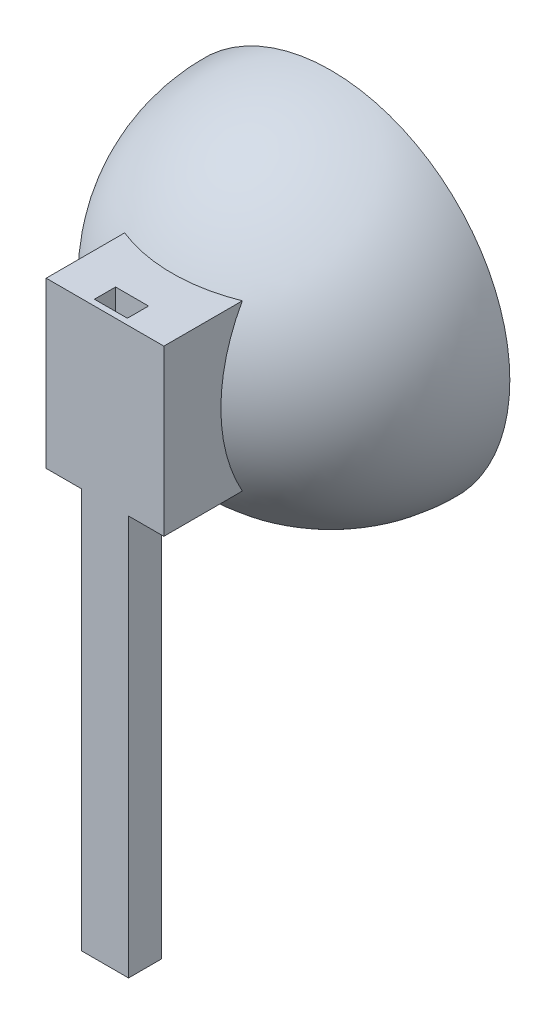
ISO-10303-21;
HEADER;
FILE_DESCRIPTION(('STEP AP214'),'2;1');
FILE_NAME('part.step','',(''),(''),'','','');
FILE_SCHEMA(('AUTOMOTIVE_DESIGN { 1 0 10303 214 1 1 1 1 }'));
ENDSEC;
DATA;
#1=APPLICATION_CONTEXT('core data for automotive mechanical design processes');
#2=APPLICATION_PROTOCOL_DEFINITION('international standard','automotive_design',2000,#1);
#3=PRODUCT_CONTEXT('',#1,'mechanical');
#4=PRODUCT('Part','Part','',(#3));
#5=PRODUCT_RELATED_PRODUCT_CATEGORY('part','',(#4));
#6=PRODUCT_DEFINITION_FORMATION('','',#4);
#7=PRODUCT_DEFINITION_CONTEXT('part definition',#1,'design');
#8=PRODUCT_DEFINITION('design','',#6,#7);
#9=PRODUCT_DEFINITION_SHAPE('','',#8);
#10=(LENGTH_UNIT() NAMED_UNIT(*) SI_UNIT(.MILLI.,.METRE.));
#11=(NAMED_UNIT(*) PLANE_ANGLE_UNIT() SI_UNIT($,.RADIAN.));
#12=(NAMED_UNIT(*) SI_UNIT($,.STERADIAN.) SOLID_ANGLE_UNIT());
#13=UNCERTAINTY_MEASURE_WITH_UNIT(LENGTH_MEASURE(1.E-05),#10,'distance_accuracy_value','');
#14=(GEOMETRIC_REPRESENTATION_CONTEXT(3) GLOBAL_UNCERTAINTY_ASSIGNED_CONTEXT((#13)) GLOBAL_UNIT_ASSIGNED_CONTEXT((#10,
#11,#12)) REPRESENTATION_CONTEXT('',''));
#15=CARTESIAN_POINT('',(0.,0.,0.));
#16=DIRECTION('',(0.,0.,1.));
#17=DIRECTION('',(1.,0.,0.));
#18=AXIS2_PLACEMENT_3D('',#15,#16,#17);
#19=CARTESIAN_POINT('',(0.,0.,0.));
#20=DIRECTION('',(0.,1.,0.));
#21=DIRECTION('',(1.,0.,0.));
#22=AXIS2_PLACEMENT_3D('',#19,#20,#21);
#23=SPHERICAL_SURFACE('',#22,33.);
#24=CARTESIAN_POINT('',(0.,0.,0.));
#25=DIRECTION('',(0.,0.,1.));
#26=DIRECTION('',(-1.,0.,0.));
#27=AXIS2_PLACEMENT_3D('',#24,#25,#26);
#28=SPHERICAL_SURFACE('',#27,33.);
#29=CARTESIAN_POINT('',(0.,0.,0.));
#30=DIRECTION('',(0.,0.,1.));
#31=DIRECTION('',(-1.,0.,0.));
#32=AXIS2_PLACEMENT_3D('',#29,#30,#31);
#33=CIRCLE('',#32,33.);
#34=CARTESIAN_POINT('',(-33.,0.,-2.30437768363647E-13));
#35=VERTEX_POINT('',#34);
#36=EDGE_CURVE('E46',#35,#35,#33,.T.);
#37=ORIENTED_EDGE('',*,*,#36,.F.);
#38=EDGE_LOOP('',(#37));
#39=FACE_BOUND('',#38,.T.);
#40=ADVANCED_FACE('F38',(#39),#28,.F.);
#41=CARTESIAN_POINT('',(0.,0.,0.));
#42=DIRECTION('',(0.,1.,0.));
#43=DIRECTION('',(1.,0.,0.));
#44=AXIS2_PLACEMENT_3D('',#41,#42,#43);
#45=SPHERICAL_SURFACE('',#44,38.);
#46=CARTESIAN_POINT('',(0.,-17.5,0.));
#47=DIRECTION('',(0.,1.,0.));
#48=DIRECTION('',(0.,0.,1.));
#49=AXIS2_PLACEMENT_3D('',#46,#47,#48);
#50=CIRCLE('',#49,33.7305499510459);
#51=CARTESIAN_POINT('',(12.4999999999998,-17.5,31.3289003956412));
#52=VERTEX_POINT('',#51);
#53=CARTESIAN_POINT('',(-12.5000000000002,-17.5,31.328900395641));
#54=VERTEX_POINT('',#53);
#55=EDGE_CURVE('E192',#52,#54,#50,.F.);
#56=ORIENTED_EDGE('',*,*,#55,.T.);
#57=CARTESIAN_POINT('',(-12.5,0.,0.));
#58=DIRECTION('',(1.,0.,0.));
#59=DIRECTION('',(0.,0.,-1.));
#60=AXIS2_PLACEMENT_3D('',#57,#58,#59);
#61=CIRCLE('',#60,35.8852337319962);
#62=CARTESIAN_POINT('',(-12.5000000000002,17.5,31.328900395641));
#63=VERTEX_POINT('',#62);
#64=EDGE_CURVE('E191',#54,#63,#61,.F.);
#65=ORIENTED_EDGE('',*,*,#64,.T.);
#66=CARTESIAN_POINT('',(0.,17.5,0.));
#67=DIRECTION('',(0.,-1.,0.));
#68=DIRECTION('',(0.,0.,-1.));
#69=AXIS2_PLACEMENT_3D('',#66,#67,#68);
#70=CIRCLE('',#69,33.7305499510459);
#71=CARTESIAN_POINT('',(12.4999999999998,17.5,31.3289003956412));
#72=VERTEX_POINT('',#71);
#73=EDGE_CURVE('E199',#63,#72,#70,.F.);
#74=ORIENTED_EDGE('',*,*,#73,.T.);
#75=CARTESIAN_POINT('',(12.5,0.,0.));
#76=DIRECTION('',(-1.,0.,0.));
#77=DIRECTION('',(0.,0.,1.));
#78=AXIS2_PLACEMENT_3D('',#75,#76,#77);
#79=CIRCLE('',#78,35.8852337319962);
#80=EDGE_CURVE('E196',#72,#52,#79,.F.);
#81=ORIENTED_EDGE('',*,*,#80,.T.);
#82=EDGE_LOOP('',(#56,#65,#74,#81));
#83=FACE_BOUND('',#82,.T.);
#84=CARTESIAN_POINT('',(0.,0.,0.));
#85=DIRECTION('',(0.,0.,-1.));
#86=DIRECTION('',(-1.,0.,0.));
#87=AXIS2_PLACEMENT_3D('',#84,#85,#86);
#88=CIRCLE('',#87,38.);
#89=CARTESIAN_POINT('',(-38.,0.,-2.65352581752078E-13));
#90=VERTEX_POINT('',#89);
#91=EDGE_CURVE('E11',#90,#90,#88,.T.);
#92=ORIENTED_EDGE('',*,*,#91,.F.);
#93=EDGE_LOOP('',(#92));
#94=FACE_BOUND('',#93,.T.);
#95=ADVANCED_FACE('F40',(#83,#94),#45,.T.);
#96=CARTESIAN_POINT('',(0.,0.,0.));
#97=DIRECTION('',(0.,0.,-1.));
#98=DIRECTION('',(-1.,0.,0.));
#99=AXIS2_PLACEMENT_3D('',#96,#97,#98);
#100=PLANE('',#99);
#101=ORIENTED_EDGE('',*,*,#91,.T.);
#102=EDGE_LOOP('',(#101));
#103=FACE_BOUND('',#102,.T.);
#104=ORIENTED_EDGE('',*,*,#36,.T.);
#105=EDGE_LOOP('',(#104));
#106=FACE_BOUND('',#105,.T.);
#107=ADVANCED_FACE('F225',(#103,#106),#100,.T.);
#108=CARTESIAN_POINT('',(-12.5000000000003,-17.5,47.9999999999999));
#109=DIRECTION('',(-1.,0.,0.));
#110=DIRECTION('',(0.,0.,1.));
#111=AXIS2_PLACEMENT_3D('',#108,#109,#110);
#112=PLANE('',#111);
#113=DIRECTION('',(0.,0.,-1.));
#114=VECTOR('',#113,1.);
#115=CARTESIAN_POINT('',(-12.5000000000003,17.5,47.9999999999999));
#116=LINE('',#115,#114);
#117=CARTESIAN_POINT('',(-12.5000000000003,17.5,47.9999999999999));
#118=VERTEX_POINT('',#117);
#119=EDGE_CURVE('E214',#118,#63,#116,.T.);
#120=ORIENTED_EDGE('',*,*,#119,.T.);
#121=ORIENTED_EDGE('',*,*,#64,.F.);
#122=DIRECTION('',(0.,0.,-1.));
#123=VECTOR('',#122,1.);
#124=CARTESIAN_POINT('',(-12.5000000000003,-17.5,47.9999999999999));
#125=LINE('',#124,#123);
#126=CARTESIAN_POINT('',(-12.5000000000003,-17.5,47.9999999999999));
#127=VERTEX_POINT('',#126);
#128=EDGE_CURVE('E215',#127,#54,#125,.T.);
#129=ORIENTED_EDGE('',*,*,#128,.F.);
#130=DIRECTION('',(0.,1.,0.));
#131=VECTOR('',#130,1.);
#132=CARTESIAN_POINT('',(-12.5000000000003,-17.5,47.9999999999999));
#133=LINE('',#132,#131);
#134=EDGE_CURVE('E195',#127,#118,#133,.T.);
#135=ORIENTED_EDGE('',*,*,#134,.T.);
#136=EDGE_LOOP('',(#120,#121,#129,#135));
#137=FACE_BOUND('',#136,.T.);
#138=ADVANCED_FACE('F235',(#137),#112,.T.);
#139=CARTESIAN_POINT('',(12.4999999999997,-17.5,48.0000000000001));
#140=DIRECTION('',(0.,-1.,0.));
#141=DIRECTION('',(0.,0.,-1.));
#142=AXIS2_PLACEMENT_3D('',#139,#140,#141);
#143=PLANE('',#142);
#144=DIRECTION('',(0.,0.,-1.));
#145=VECTOR('',#144,1.);
#146=CARTESIAN_POINT('',(-5.00000000000034,-17.5,48.0000000000001));
#147=LINE('',#146,#145);
#148=CARTESIAN_POINT('',(-5.00000000000034,-17.5,48.));
#149=VERTEX_POINT('',#148);
#150=CARTESIAN_POINT('',(-5.00000000000034,-17.5,41.));
#151=VERTEX_POINT('',#150);
#152=EDGE_CURVE('E186',#149,#151,#147,.T.);
#153=ORIENTED_EDGE('',*,*,#152,.F.);
#154=DIRECTION('',(-1.,0.,0.));
#155=VECTOR('',#154,1.);
#156=CARTESIAN_POINT('',(12.4999999999997,-17.5,48.0000000000001));
#157=LINE('',#156,#155);
#158=EDGE_CURVE('E211',#149,#127,#157,.T.);
#159=ORIENTED_EDGE('',*,*,#158,.T.);
#160=ORIENTED_EDGE('',*,*,#128,.T.);
#161=ORIENTED_EDGE('',*,*,#55,.F.);
#162=DIRECTION('',(0.,0.,-1.));
#163=VECTOR('',#162,1.);
#164=CARTESIAN_POINT('',(12.4999999999997,-17.5,48.0000000000001));
#165=LINE('',#164,#163);
#166=CARTESIAN_POINT('',(12.4999999999997,-17.5,48.0000000000001));
#167=VERTEX_POINT('',#166);
#168=EDGE_CURVE('E217',#167,#52,#165,.T.);
#169=ORIENTED_EDGE('',*,*,#168,.F.);
#170=CARTESIAN_POINT('',(4.99999999999966,-17.5,48.));
#171=VERTEX_POINT('',#170);
#172=EDGE_CURVE('E212',#167,#171,#157,.T.);
#173=ORIENTED_EDGE('',*,*,#172,.T.);
#174=DIRECTION('',(0.,0.,1.));
#175=VECTOR('',#174,1.);
#176=CARTESIAN_POINT('',(4.99999999999966,-17.5,48.0000000000001));
#177=LINE('',#176,#175);
#178=CARTESIAN_POINT('',(4.99999999999967,-17.5,41.));
#179=VERTEX_POINT('',#178);
#180=EDGE_CURVE('E181',#179,#171,#177,.T.);
#181=ORIENTED_EDGE('',*,*,#180,.F.);
#182=DIRECTION('',(-1.,0.,0.));
#183=VECTOR('',#182,1.);
#184=CARTESIAN_POINT('',(12.4999999999997,-17.5,41.));
#185=LINE('',#184,#183);
#186=EDGE_CURVE('E189',#179,#151,#185,.T.);
#187=ORIENTED_EDGE('',*,*,#186,.T.);
#188=EDGE_LOOP('',(#153,#159,#160,#161,#169,#173,#181,#187));
#189=FACE_BOUND('',#188,.T.);
#190=ADVANCED_FACE('F239',(#189),#143,.T.);
#191=CARTESIAN_POINT('',(12.4999999999997,-17.5,48.0000000000001));
#192=DIRECTION('',(1.,0.,0.));
#193=DIRECTION('',(0.,0.,-1.));
#194=AXIS2_PLACEMENT_3D('',#191,#192,#193);
#195=PLANE('',#194);
#196=ORIENTED_EDGE('',*,*,#168,.T.);
#197=ORIENTED_EDGE('',*,*,#80,.F.);
#198=DIRECTION('',(0.,0.,-1.));
#199=VECTOR('',#198,1.);
#200=CARTESIAN_POINT('',(12.4999999999997,17.5,48.0000000000001));
#201=LINE('',#200,#199);
#202=CARTESIAN_POINT('',(12.4999999999997,17.5,48.0000000000001));
#203=VERTEX_POINT('',#202);
#204=EDGE_CURVE('E219',#203,#72,#201,.T.);
#205=ORIENTED_EDGE('',*,*,#204,.F.);
#206=DIRECTION('',(0.,-1.,0.));
#207=VECTOR('',#206,1.);
#208=CARTESIAN_POINT('',(12.4999999999997,-17.5,48.0000000000001));
#209=LINE('',#208,#207);
#210=EDGE_CURVE('E208',#203,#167,#209,.T.);
#211=ORIENTED_EDGE('',*,*,#210,.T.);
#212=EDGE_LOOP('',(#196,#197,#205,#211));
#213=FACE_BOUND('',#212,.T.);
#214=ADVANCED_FACE('F245',(#213),#195,.T.);
#215=CARTESIAN_POINT('',(12.4999999999997,17.5,48.0000000000001));
#216=DIRECTION('',(0.,1.,0.));
#217=DIRECTION('',(0.,0.,1.));
#218=AXIS2_PLACEMENT_3D('',#215,#216,#217);
#219=PLANE('',#218);
#220=DIRECTION('',(0.,0.,-1.));
#221=VECTOR('',#220,1.);
#222=CARTESIAN_POINT('',(3.49999999999969,17.5,48.0000000000001));
#223=LINE('',#222,#221);
#224=CARTESIAN_POINT('',(3.49999999999969,17.5,46.75));
#225=VERTEX_POINT('',#224);
#226=CARTESIAN_POINT('',(3.49999999999969,17.5,42.25));
#227=VERTEX_POINT('',#226);
#228=EDGE_CURVE('E160',#225,#227,#223,.T.);
#229=ORIENTED_EDGE('',*,*,#228,.F.);
#230=DIRECTION('',(1.,0.,0.));
#231=VECTOR('',#230,1.);
#232=CARTESIAN_POINT('',(12.4999999999997,17.5,46.75));
#233=LINE('',#232,#231);
#234=CARTESIAN_POINT('',(-3.50000000000031,17.5,46.75));
#235=VERTEX_POINT('',#234);
#236=EDGE_CURVE('E153',#235,#225,#233,.T.);
#237=ORIENTED_EDGE('',*,*,#236,.F.);
#238=DIRECTION('',(0.,0.,1.));
#239=VECTOR('',#238,1.);
#240=CARTESIAN_POINT('',(-3.50000000000031,17.5,48.0000000000001));
#241=LINE('',#240,#239);
#242=CARTESIAN_POINT('',(-3.50000000000031,17.5,42.25));
#243=VERTEX_POINT('',#242);
#244=EDGE_CURVE('E133',#243,#235,#241,.T.);
#245=ORIENTED_EDGE('',*,*,#244,.F.);
#246=DIRECTION('',(-1.,0.,0.));
#247=VECTOR('',#246,1.);
#248=CARTESIAN_POINT('',(12.4999999999997,17.5,42.25));
#249=LINE('',#248,#247);
#250=EDGE_CURVE('E158',#227,#243,#249,.T.);
#251=ORIENTED_EDGE('',*,*,#250,.F.);
#252=EDGE_LOOP('',(#229,#237,#245,#251));
#253=FACE_BOUND('',#252,.T.);
#254=DIRECTION('',(1.,0.,0.));
#255=VECTOR('',#254,1.);
#256=CARTESIAN_POINT('',(12.4999999999997,17.5,48.0000000000001));
#257=LINE('',#256,#255);
#258=EDGE_CURVE('E206',#118,#203,#257,.T.);
#259=ORIENTED_EDGE('',*,*,#258,.T.);
#260=ORIENTED_EDGE('',*,*,#204,.T.);
#261=ORIENTED_EDGE('',*,*,#73,.F.);
#262=ORIENTED_EDGE('',*,*,#119,.F.);
#263=EDGE_LOOP('',(#259,#260,#261,#262));
#264=FACE_BOUND('',#263,.T.);
#265=ADVANCED_FACE('F241',(#253,#264),#219,.T.);
#266=CARTESIAN_POINT('',(-3.44054713859276E-13,0.,48.));
#267=DIRECTION('',(0.,0.,1.));
#268=DIRECTION('',(1.,0.,0.));
#269=AXIS2_PLACEMENT_3D('',#266,#267,#268);
#270=PLANE('',#269);
#271=ORIENTED_EDGE('',*,*,#210,.F.);
#272=ORIENTED_EDGE('',*,*,#258,.F.);
#273=ORIENTED_EDGE('',*,*,#134,.F.);
#274=ORIENTED_EDGE('',*,*,#158,.F.);
#275=DIRECTION('',(0.,-1.,0.));
#276=VECTOR('',#275,1.);
#277=CARTESIAN_POINT('',(-5.00000000000035,17.5,48.));
#278=LINE('',#277,#276);
#279=CARTESIAN_POINT('',(-5.00000000000033,-102.5,48.));
#280=VERTEX_POINT('',#279);
#281=EDGE_CURVE('E162',#149,#280,#278,.T.);
#282=ORIENTED_EDGE('',*,*,#281,.T.);
#283=DIRECTION('',(1.,0.,0.));
#284=VECTOR('',#283,1.);
#285=CARTESIAN_POINT('',(-5.00000000000033,-102.5,48.));
#286=LINE('',#285,#284);
#287=CARTESIAN_POINT('',(4.99999999999967,-102.5,48.));
#288=VERTEX_POINT('',#287);
#289=EDGE_CURVE('E174',#280,#288,#286,.T.);
#290=ORIENTED_EDGE('',*,*,#289,.T.);
#291=DIRECTION('',(0.,1.,0.));
#292=VECTOR('',#291,1.);
#293=CARTESIAN_POINT('',(4.99999999999965,17.5,48.));
#294=LINE('',#293,#292);
#295=EDGE_CURVE('E166',#288,#171,#294,.T.);
#296=ORIENTED_EDGE('',*,*,#295,.T.);
#297=ORIENTED_EDGE('',*,*,#172,.F.);
#298=EDGE_LOOP('',(#271,#272,#273,#274,#282,#290,#296,#297));
#299=FACE_BOUND('',#298,.T.);
#300=ADVANCED_FACE('F244',(#299),#270,.T.);
#301=CARTESIAN_POINT('',(-5.00000000000035,17.5,41.));
#302=DIRECTION('',(-1.,0.,0.));
#303=DIRECTION('',(0.,-1.,0.));
#304=AXIS2_PLACEMENT_3D('',#301,#302,#303);
#305=PLANE('',#304);
#306=ORIENTED_EDGE('',*,*,#281,.F.);
#307=ORIENTED_EDGE('',*,*,#152,.T.);
#308=DIRECTION('',(0.,-1.,0.));
#309=VECTOR('',#308,1.);
#310=CARTESIAN_POINT('',(-5.00000000000035,17.5,41.));
#311=LINE('',#310,#309);
#312=CARTESIAN_POINT('',(-5.00000000000033,-102.5,41.));
#313=VERTEX_POINT('',#312);
#314=EDGE_CURVE('E163',#151,#313,#311,.T.);
#315=ORIENTED_EDGE('',*,*,#314,.T.);
#316=DIRECTION('',(0.,0.,1.));
#317=VECTOR('',#316,1.);
#318=CARTESIAN_POINT('',(-5.00000000000033,-102.5,41.));
#319=LINE('',#318,#317);
#320=EDGE_CURVE('E172',#313,#280,#319,.T.);
#321=ORIENTED_EDGE('',*,*,#320,.T.);
#322=EDGE_LOOP('',(#306,#307,#315,#321));
#323=FACE_BOUND('',#322,.T.);
#324=ADVANCED_FACE('F255',(#323),#305,.T.);
#325=CARTESIAN_POINT('',(4.99999999999965,17.5,41.));
#326=DIRECTION('',(1.,0.,0.));
#327=DIRECTION('',(0.,1.,0.));
#328=AXIS2_PLACEMENT_3D('',#325,#326,#327);
#329=PLANE('',#328);
#330=DIRECTION('',(0.,1.,0.));
#331=VECTOR('',#330,1.);
#332=CARTESIAN_POINT('',(4.99999999999965,17.5,41.));
#333=LINE('',#332,#331);
#334=CARTESIAN_POINT('',(4.99999999999967,-102.5,41.));
#335=VERTEX_POINT('',#334);
#336=EDGE_CURVE('E169',#335,#179,#333,.T.);
#337=ORIENTED_EDGE('',*,*,#336,.T.);
#338=ORIENTED_EDGE('',*,*,#180,.T.);
#339=ORIENTED_EDGE('',*,*,#295,.F.);
#340=DIRECTION('',(0.,0.,1.));
#341=VECTOR('',#340,1.);
#342=CARTESIAN_POINT('',(4.99999999999967,-102.5,41.));
#343=LINE('',#342,#341);
#344=EDGE_CURVE('E179',#335,#288,#343,.T.);
#345=ORIENTED_EDGE('',*,*,#344,.F.);
#346=EDGE_LOOP('',(#337,#338,#339,#345));
#347=FACE_BOUND('',#346,.T.);
#348=ADVANCED_FACE('F259',(#347),#329,.T.);
#349=CARTESIAN_POINT('',(-5.00000000000033,-102.5,41.));
#350=DIRECTION('',(0.,-1.,0.));
#351=DIRECTION('',(0.,0.,-1.));
#352=AXIS2_PLACEMENT_3D('',#349,#350,#351);
#353=PLANE('',#352);
#354=DIRECTION('',(0.,0.,1.));
#355=VECTOR('',#354,1.);
#356=CARTESIAN_POINT('',(3.49999999999969,-102.5,42.25));
#357=LINE('',#356,#355);
#358=CARTESIAN_POINT('',(3.49999999999969,-102.5,42.25));
#359=VERTEX_POINT('',#358);
#360=CARTESIAN_POINT('',(3.49999999999969,-102.5,46.75));
#361=VERTEX_POINT('',#360);
#362=EDGE_CURVE('E61',#359,#361,#357,.T.);
#363=ORIENTED_EDGE('',*,*,#362,.F.);
#364=DIRECTION('',(1.,0.,0.));
#365=VECTOR('',#364,1.);
#366=CARTESIAN_POINT('',(3.49999999999969,-102.5,42.25));
#367=LINE('',#366,#365);
#368=CARTESIAN_POINT('',(-3.50000000000031,-102.5,42.25));
#369=VERTEX_POINT('',#368);
#370=EDGE_CURVE('E146',#369,#359,#367,.T.);
#371=ORIENTED_EDGE('',*,*,#370,.F.);
#372=DIRECTION('',(0.,0.,-1.));
#373=VECTOR('',#372,1.);
#374=CARTESIAN_POINT('',(-3.50000000000031,-102.5,42.25));
#375=LINE('',#374,#373);
#376=CARTESIAN_POINT('',(-3.50000000000031,-102.5,46.75));
#377=VERTEX_POINT('',#376);
#378=EDGE_CURVE('E130',#377,#369,#375,.T.);
#379=ORIENTED_EDGE('',*,*,#378,.F.);
#380=DIRECTION('',(-1.,0.,0.));
#381=VECTOR('',#380,1.);
#382=CARTESIAN_POINT('',(3.49999999999969,-102.5,46.75));
#383=LINE('',#382,#381);
#384=EDGE_CURVE('E139',#361,#377,#383,.T.);
#385=ORIENTED_EDGE('',*,*,#384,.F.);
#386=EDGE_LOOP('',(#363,#371,#379,#385));
#387=FACE_BOUND('',#386,.T.);
#388=ORIENTED_EDGE('',*,*,#289,.F.);
#389=ORIENTED_EDGE('',*,*,#320,.F.);
#390=DIRECTION('',(1.,0.,0.));
#391=VECTOR('',#390,1.);
#392=CARTESIAN_POINT('',(-5.00000000000033,-102.5,41.));
#393=LINE('',#392,#391);
#394=EDGE_CURVE('E165',#313,#335,#393,.T.);
#395=ORIENTED_EDGE('',*,*,#394,.T.);
#396=ORIENTED_EDGE('',*,*,#344,.T.);
#397=EDGE_LOOP('',(#388,#389,#395,#396));
#398=FACE_BOUND('',#397,.T.);
#399=ADVANCED_FACE('F143',(#387,#398),#353,.T.);
#400=CARTESIAN_POINT('',(0.,0.,41.));
#401=DIRECTION('',(0.,0.,1.));
#402=DIRECTION('',(1.,0.,0.));
#403=AXIS2_PLACEMENT_3D('',#400,#401,#402);
#404=PLANE('',#403);
#405=ORIENTED_EDGE('',*,*,#186,.F.);
#406=ORIENTED_EDGE('',*,*,#336,.F.);
#407=ORIENTED_EDGE('',*,*,#394,.F.);
#408=ORIENTED_EDGE('',*,*,#314,.F.);
#409=EDGE_LOOP('',(#405,#406,#407,#408));
#410=FACE_BOUND('',#409,.T.);
#411=ADVANCED_FACE('F263',(#410),#404,.F.);
#412=CARTESIAN_POINT('',(3.49999999999969,162.5,42.25));
#413=DIRECTION('',(1.,0.,0.));
#414=DIRECTION('',(0.,0.,-1.));
#415=AXIS2_PLACEMENT_3D('',#412,#413,#414);
#416=PLANE('',#415);
#417=ORIENTED_EDGE('',*,*,#228,.T.);
#418=DIRECTION('',(0.,-1.,0.));
#419=VECTOR('',#418,1.);
#420=CARTESIAN_POINT('',(3.49999999999969,162.5,42.25));
#421=LINE('',#420,#419);
#422=EDGE_CURVE('E151',#227,#359,#421,.T.);
#423=ORIENTED_EDGE('',*,*,#422,.T.);
#424=ORIENTED_EDGE('',*,*,#362,.T.);
#425=DIRECTION('',(0.,-1.,0.));
#426=VECTOR('',#425,1.);
#427=CARTESIAN_POINT('',(3.49999999999969,162.5,46.75));
#428=LINE('',#427,#426);
#429=EDGE_CURVE('E136',#225,#361,#428,.T.);
#430=ORIENTED_EDGE('',*,*,#429,.F.);
#431=EDGE_LOOP('',(#417,#423,#424,#430));
#432=FACE_BOUND('',#431,.T.);
#433=ADVANCED_FACE('F269',(#432),#416,.F.);
#434=CARTESIAN_POINT('',(3.49999999999969,162.5,42.25));
#435=DIRECTION('',(0.,0.,-1.));
#436=DIRECTION('',(-1.,0.,0.));
#437=AXIS2_PLACEMENT_3D('',#434,#435,#436);
#438=PLANE('',#437);
#439=ORIENTED_EDGE('',*,*,#250,.T.);
#440=DIRECTION('',(0.,-1.,0.));
#441=VECTOR('',#440,1.);
#442=CARTESIAN_POINT('',(-3.50000000000031,162.5,42.25));
#443=LINE('',#442,#441);
#444=EDGE_CURVE('E135',#243,#369,#443,.T.);
#445=ORIENTED_EDGE('',*,*,#444,.T.);
#446=ORIENTED_EDGE('',*,*,#370,.T.);
#447=ORIENTED_EDGE('',*,*,#422,.F.);
#448=EDGE_LOOP('',(#439,#445,#446,#447));
#449=FACE_BOUND('',#448,.T.);
#450=ADVANCED_FACE('F273',(#449),#438,.F.);
#451=CARTESIAN_POINT('',(-3.50000000000031,162.5,42.25));
#452=DIRECTION('',(-1.,0.,0.));
#453=DIRECTION('',(0.,0.,1.));
#454=AXIS2_PLACEMENT_3D('',#451,#452,#453);
#455=PLANE('',#454);
#456=ORIENTED_EDGE('',*,*,#244,.T.);
#457=DIRECTION('',(0.,-1.,0.));
#458=VECTOR('',#457,1.);
#459=CARTESIAN_POINT('',(-3.50000000000031,162.5,46.75));
#460=LINE('',#459,#458);
#461=EDGE_CURVE('E53',#235,#377,#460,.T.);
#462=ORIENTED_EDGE('',*,*,#461,.T.);
#463=ORIENTED_EDGE('',*,*,#378,.T.);
#464=ORIENTED_EDGE('',*,*,#444,.F.);
#465=EDGE_LOOP('',(#456,#462,#463,#464));
#466=FACE_BOUND('',#465,.T.);
#467=ADVANCED_FACE('F127',(#466),#455,.F.);
#468=CARTESIAN_POINT('',(3.49999999999969,162.5,46.75));
#469=DIRECTION('',(0.,0.,1.));
#470=DIRECTION('',(1.,0.,0.));
#471=AXIS2_PLACEMENT_3D('',#468,#469,#470);
#472=PLANE('',#471);
#473=ORIENTED_EDGE('',*,*,#236,.T.);
#474=ORIENTED_EDGE('',*,*,#429,.T.);
#475=ORIENTED_EDGE('',*,*,#384,.T.);
#476=ORIENTED_EDGE('',*,*,#461,.F.);
#477=EDGE_LOOP('',(#473,#474,#475,#476));
#478=FACE_BOUND('',#477,.T.);
#479=ADVANCED_FACE('F140',(#478),#472,.F.);
#480=CLOSED_SHELL('',(#40,#95,#107,#138,#190,#214,#265,#300,#324,#348,#399,#411,#433,#450,#467,#479));
#481=MANIFOLD_SOLID_BREP('B2',#480);
#482=ADVANCED_BREP_SHAPE_REPRESENTATION('',(#18,#481),#14);
#483=SHAPE_DEFINITION_REPRESENTATION(#9,#482);
ENDSEC;
END-ISO-10303-21;
